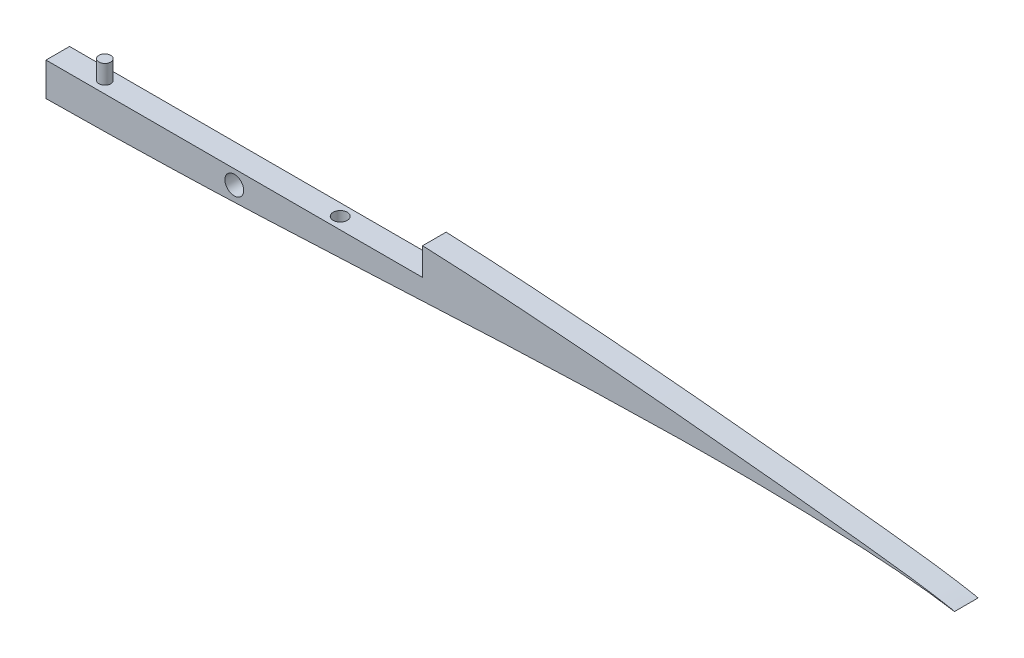
ISO-10303-21;
HEADER;
FILE_DESCRIPTION(('STEP AP214'),'2;1');
FILE_NAME('part.step','',(''),(''),'','','');
FILE_SCHEMA(('AUTOMOTIVE_DESIGN { 1 0 10303 214 1 1 1 1 }'));
ENDSEC;
DATA;
#1=APPLICATION_CONTEXT('core data for automotive mechanical design processes');
#2=APPLICATION_PROTOCOL_DEFINITION('international standard','automotive_design',2000,#1);
#3=PRODUCT_CONTEXT('',#1,'mechanical');
#4=PRODUCT('Part','Part','',(#3));
#5=PRODUCT_RELATED_PRODUCT_CATEGORY('part','',(#4));
#6=PRODUCT_DEFINITION_FORMATION('','',#4);
#7=PRODUCT_DEFINITION_CONTEXT('part definition',#1,'design');
#8=PRODUCT_DEFINITION('design','',#6,#7);
#9=PRODUCT_DEFINITION_SHAPE('','',#8);
#10=(LENGTH_UNIT() NAMED_UNIT(*) SI_UNIT(.MILLI.,.METRE.));
#11=(NAMED_UNIT(*) PLANE_ANGLE_UNIT() SI_UNIT($,.RADIAN.));
#12=(NAMED_UNIT(*) SI_UNIT($,.STERADIAN.) SOLID_ANGLE_UNIT());
#13=UNCERTAINTY_MEASURE_WITH_UNIT(LENGTH_MEASURE(1.E-05),#10,'distance_accuracy_value','');
#14=(GEOMETRIC_REPRESENTATION_CONTEXT(3) GLOBAL_UNCERTAINTY_ASSIGNED_CONTEXT((#13)) GLOBAL_UNIT_ASSIGNED_CONTEXT((#10,
#11,#12)) REPRESENTATION_CONTEXT('',''));
#15=CARTESIAN_POINT('',(0.,0.,0.));
#16=DIRECTION('',(0.,0.,1.));
#17=DIRECTION('',(1.,0.,0.));
#18=AXIS2_PLACEMENT_3D('',#15,#16,#17);
#19=CARTESIAN_POINT('',(161.29,15.1503407577075,-8.9));
#20=DIRECTION('',(1.,0.,0.));
#21=DIRECTION('',(0.,0.,-1.));
#22=AXIS2_PLACEMENT_3D('',#19,#20,#21);
#23=PLANE('',#22);
#24=DIRECTION('',(0.,0.,1.));
#25=VECTOR('',#24,1.);
#26=CARTESIAN_POINT('',(161.29,15.1503407577075,-8.9));
#27=LINE('',#26,#25);
#28=CARTESIAN_POINT('',(161.29,15.1503407577075,-6.35));
#29=VERTEX_POINT('',#28);
#30=CARTESIAN_POINT('',(161.29,15.1503407577075,0.));
#31=VERTEX_POINT('',#30);
#32=EDGE_CURVE('E62',#29,#31,#27,.T.);
#33=ORIENTED_EDGE('',*,*,#32,.T.);
#34=DIRECTION('',(0.,1.,0.));
#35=VECTOR('',#34,1.);
#36=CARTESIAN_POINT('',(161.29,8.84070521921784,0.));
#37=LINE('',#36,#35);
#38=CARTESIAN_POINT('',(161.28999998063,22.5713507156174,0.));
#39=VERTEX_POINT('',#38);
#40=EDGE_CURVE('E139',#31,#39,#37,.T.);
#41=ORIENTED_EDGE('',*,*,#40,.T.);
#42=DIRECTION('',(0.,0.,1.));
#43=VECTOR('',#42,1.);
#44=CARTESIAN_POINT('',(161.290000000003,22.5713507147177,-6.35));
#45=LINE('',#44,#43);
#46=CARTESIAN_POINT('',(161.289999982265,22.5713507155415,-6.35));
#47=VERTEX_POINT('',#46);
#48=EDGE_CURVE('E69',#39,#47,#45,.F.);
#49=ORIENTED_EDGE('',*,*,#48,.T.);
#50=DIRECTION('',(0.,1.,0.));
#51=VECTOR('',#50,1.);
#52=CARTESIAN_POINT('',(161.29,8.84070521921784,-6.35));
#53=LINE('',#52,#51);
#54=EDGE_CURVE('E114',#29,#47,#53,.T.);
#55=ORIENTED_EDGE('',*,*,#54,.F.);
#56=EDGE_LOOP('',(#33,#41,#49,#55));
#57=FACE_BOUND('',#56,.T.);
#58=ADVANCED_FACE('F53',(#57),#23,.F.);
#59=CARTESIAN_POINT('',(59.69,15.1503407577075,-8.9));
#60=DIRECTION('',(0.,-1.,0.));
#61=DIRECTION('',(0.,0.,-1.));
#62=AXIS2_PLACEMENT_3D('',#59,#60,#61);
#63=PLANE('',#62);
#64=CARTESIAN_POINT('',(135.89,15.1503407577075,-3.17500000000001));
#65=DIRECTION('',(0.,1.,0.));
#66=DIRECTION('',(0.,0.,1.));
#67=AXIS2_PLACEMENT_3D('',#64,#65,#66);
#68=CIRCLE('',#67,1.90499999999999);
#69=CARTESIAN_POINT('',(135.89,15.1503407577075,-1.27000000000002));
#70=VERTEX_POINT('',#69);
#71=EDGE_CURVE('E170',#70,#70,#68,.T.);
#72=ORIENTED_EDGE('',*,*,#71,.F.);
#73=EDGE_LOOP('',(#72));
#74=FACE_BOUND('',#73,.T.);
#75=CARTESIAN_POINT('',(72.39,15.1503407577075,-3.175));
#76=DIRECTION('',(0.,-1.,0.));
#77=DIRECTION('',(0.,0.,-1.));
#78=AXIS2_PLACEMENT_3D('',#75,#76,#77);
#79=CIRCLE('',#78,1.5875);
#80=CARTESIAN_POINT('',(72.39,15.1503407577075,-4.7625));
#81=VERTEX_POINT('',#80);
#82=EDGE_CURVE('E12',#81,#81,#79,.F.);
#83=ORIENTED_EDGE('',*,*,#82,.F.);
#84=EDGE_LOOP('',(#83));
#85=FACE_BOUND('',#84,.T.);
#86=DIRECTION('',(0.,0.,1.));
#87=VECTOR('',#86,1.);
#88=CARTESIAN_POINT('',(59.69,15.1503407577075,-8.9));
#89=LINE('',#88,#87);
#90=CARTESIAN_POINT('',(59.69,15.1503407577075,-6.35));
#91=VERTEX_POINT('',#90);
#92=CARTESIAN_POINT('',(59.69,15.1503407577075,0.));
#93=VERTEX_POINT('',#92);
#94=EDGE_CURVE('E102',#91,#93,#89,.T.);
#95=ORIENTED_EDGE('',*,*,#94,.T.);
#96=DIRECTION('',(1.,0.,0.));
#97=VECTOR('',#96,1.);
#98=CARTESIAN_POINT('',(0.,15.1503407577075,0.));
#99=LINE('',#98,#97);
#100=EDGE_CURVE('E175',#93,#31,#99,.T.);
#101=ORIENTED_EDGE('',*,*,#100,.T.);
#102=ORIENTED_EDGE('',*,*,#32,.F.);
#103=DIRECTION('',(1.,0.,0.));
#104=VECTOR('',#103,1.);
#105=CARTESIAN_POINT('',(0.,15.1503407577075,-6.35));
#106=LINE('',#105,#104);
#107=EDGE_CURVE('E107',#91,#29,#106,.T.);
#108=ORIENTED_EDGE('',*,*,#107,.F.);
#109=EDGE_LOOP('',(#95,#101,#102,#108));
#110=FACE_BOUND('',#109,.T.);
#111=ADVANCED_FACE('F158',(#74,#85,#110),#63,.F.);
#112=CARTESIAN_POINT('',(59.69,6.13469849844112,-8.9));
#113=DIRECTION('',(1.,0.,0.));
#114=DIRECTION('',(0.,1.,0.));
#115=AXIS2_PLACEMENT_3D('',#112,#113,#114);
#116=PLANE('',#115);
#117=DIRECTION('',(0.,0.,1.));
#118=VECTOR('',#117,1.);
#119=CARTESIAN_POINT('',(59.69,6.13469849844112,-6.35));
#120=LINE('',#119,#118);
#121=CARTESIAN_POINT('',(59.6900000194774,6.13469849862517,-6.35));
#122=VERTEX_POINT('',#121);
#123=CARTESIAN_POINT('',(59.6900000078065,6.13469849851489,0.));
#124=VERTEX_POINT('',#123);
#125=EDGE_CURVE('E100',#122,#124,#120,.T.);
#126=ORIENTED_EDGE('',*,*,#125,.T.);
#127=DIRECTION('',(0.,1.,0.));
#128=VECTOR('',#127,1.);
#129=CARTESIAN_POINT('',(59.69,8.84070521921812,0.));
#130=LINE('',#129,#128);
#131=EDGE_CURVE('E77',#124,#93,#130,.T.);
#132=ORIENTED_EDGE('',*,*,#131,.T.);
#133=ORIENTED_EDGE('',*,*,#94,.F.);
#134=DIRECTION('',(0.,1.,0.));
#135=VECTOR('',#134,1.);
#136=CARTESIAN_POINT('',(59.69,8.84070521921812,-6.35));
#137=LINE('',#136,#135);
#138=EDGE_CURVE('E98',#122,#91,#137,.T.);
#139=ORIENTED_EDGE('',*,*,#138,.F.);
#140=EDGE_LOOP('',(#126,#132,#133,#139));
#141=FACE_BOUND('',#140,.T.);
#142=ADVANCED_FACE('F55',(#141),#116,.F.);
#143=CARTESIAN_POINT('',(304.799999999981,8.84070521921933,-6.35));
#144=CARTESIAN_POINT('',(304.82012511006,8.84631285964664,-6.35));
#145=CARTESIAN_POINT('',(304.136800474963,9.03902480051447,-6.35));
#146=CARTESIAN_POINT('',(303.375322867857,9.15622667599064,-6.35));
#147=CARTESIAN_POINT('',(301.636958583189,9.50750977522462,-6.35));
#148=CARTESIAN_POINT('',(299.426767542794,9.86946342232527,-6.35));
#149=CARTESIAN_POINT('',(296.518953252407,10.3280137970568,-6.35));
#150=CARTESIAN_POINT('',(293.018467792338,10.8248006115008,-6.35));
#151=CARTESIAN_POINT('',(288.900536794578,11.3604446078168,-6.35));
#152=CARTESIAN_POINT('',(284.20488543612,11.9350149043221,-6.35));
#153=CARTESIAN_POINT('',(278.940836996143,12.5424058482791,-6.35));
#154=CARTESIAN_POINT('',(273.143680748259,13.1966681821014,-6.35));
#155=CARTESIAN_POINT('',(266.817821912119,13.8725849504242,-6.35));
#156=CARTESIAN_POINT('',(260.019791181675,14.6075350842126,-6.35));
#157=CARTESIAN_POINT('',(252.741163128342,15.3430480029051,-6.35));
#158=CARTESIAN_POINT('',(245.055559940884,16.1316410738847,-6.35));
#159=CARTESIAN_POINT('',(236.946583275121,16.9004918519383,-6.35));
#160=CARTESIAN_POINT('',(228.50806834568,17.7310713087232,-6.35));
#161=CARTESIAN_POINT('',(219.707729735365,18.5083518913135,-6.35));
#162=CARTESIAN_POINT('',(210.662190304429,19.3412075828542,-6.35));
#163=CARTESIAN_POINT('',(201.320827802424,20.0634796030617,-6.35));
#164=CARTESIAN_POINT('',(191.81436274904,20.8225568753487,-6.35));
#165=CARTESIAN_POINT('',(182.095576055478,21.4369535138529,-6.35));
#166=CARTESIAN_POINT('',(172.287559076656,22.0672690152254,-6.35));
#167=CARTESIAN_POINT('',(162.356893374379,22.518814519303,-6.35));
#168=CARTESIAN_POINT('',(152.417144653895,22.9887641852325,-6.35));
#169=CARTESIAN_POINT('',(142.44998973437,23.2631888682384,-6.35));
#170=CARTESIAN_POINT('',(132.545731827396,23.5587248765443,-6.35));
#171=CARTESIAN_POINT('',(122.711151747147,23.6306797752969,-6.35));
#172=CARTESIAN_POINT('',(113.011215012495,23.7435191260893,-6.35));
#173=CARTESIAN_POINT('',(103.482364760243,23.6197363639542,-6.35));
#174=CARTESIAN_POINT('',(94.1488885556725,23.5468423795136,-6.35));
#175=CARTESIAN_POINT('',(85.0905583388243,23.210955777479,-6.35));
#176=CARTESIAN_POINT('',(76.2768863370618,22.9416863066447,-6.35));
#177=CARTESIAN_POINT('',(67.8519762746337,22.39335883634,-6.35));
#178=CARTESIAN_POINT('',(59.7069752921567,21.94928194029,-6.35));
#179=CARTESIAN_POINT('',(52.0619893188443,21.2297342150995,-6.35));
#180=CARTESIAN_POINT('',(44.7167570215174,20.6372821517927,-6.35));
#181=CARTESIAN_POINT('',(37.9876033572043,19.7668625247563,-6.35));
#182=CARTESIAN_POINT('',(31.5607732931736,19.0486900589922,-6.35));
#183=CARTESIAN_POINT('',(25.8754576009877,18.0589252374282,-6.35));
#184=CARTESIAN_POINT('',(20.4601924749335,17.2533276483172,-6.35));
#185=CARTESIAN_POINT('',(15.909712958431,16.1912407780387,-6.35));
#186=CARTESIAN_POINT('',(11.7163514600433,15.2935302964436,-6.35));
#187=CARTESIAN_POINT('',(8.10119886749456,14.3664770407369,-6.35));
#188=CARTESIAN_POINT('',(5.23539854810055,13.3140242079338,-6.35));
#189=CARTESIAN_POINT('',(2.829740512964,12.2266690037572,-6.35));
#190=CARTESIAN_POINT('',(1.32933654825175,11.0569945812739,-6.35));
#191=CARTESIAN_POINT('',(0.30893287897361,9.96202306394524,-6.35));
#192=CARTESIAN_POINT('',(-0.327964979036775,9.08514150658472,-6.35));
#193=CARTESIAN_POINT('',(0.386118085619972,8.46863099498004,-6.35));
#194=CARTESIAN_POINT('',(1.48628448770953,8.09706488826065,-6.35));
#195=CARTESIAN_POINT('',(2.91553478278213,7.53360793392789,-6.35));
#196=CARTESIAN_POINT('',(5.42599691726199,7.31234324596362,-6.35));
#197=CARTESIAN_POINT('',(8.21752623726995,6.88917090941392,-6.35));
#198=CARTESIAN_POINT('',(11.8176125283229,6.78962282805451,-6.35));
#199=CARTESIAN_POINT('',(15.8861038773983,6.48630873361207,-6.35));
#200=CARTESIAN_POINT('',(20.6137138087003,6.43225221234843,-6.35));
#201=CARTESIAN_POINT('',(25.8553271607826,6.21288829812365,-6.35));
#202=CARTESIAN_POINT('',(31.6684761822158,6.20211037559508,-6.35));
#203=CARTESIAN_POINT('',(37.9798321369844,6.05679272016892,-6.35));
#204=CARTESIAN_POINT('',(44.7918582149559,6.09900778163849,-6.35));
#205=CARTESIAN_POINT('',(52.0608929040826,6.03561890061155,-6.35));
#206=CARTESIAN_POINT('',(59.7564196110845,6.14957068083345,-6.35));
#207=CARTESIAN_POINT('',(67.8558049315251,6.18195746075115,-6.35));
#208=CARTESIAN_POINT('',(76.3079562173627,6.37315809616739,-6.35));
#209=CARTESIAN_POINT('',(85.0990793898782,6.50944224275813,-6.35));
#210=CARTESIAN_POINT('',(94.1629433787314,6.79146182038362,-6.35));
#211=CARTESIAN_POINT('',(103.491777789475,7.04316865662328,-6.35));
#212=CARTESIAN_POINT('',(113.013413144931,7.42201917573048,-6.35));
#213=CARTESIAN_POINT('',(122.717663003627,7.79686999507074,-6.35));
#214=CARTESIAN_POINT('',(132.538395015459,8.24919641541521,-6.35));
#215=CARTESIAN_POINT('',(142.452771401736,8.70791868634346,-6.35));
#216=CARTESIAN_POINT('',(152.399232196453,9.21715400388623,-6.35));
#217=CARTESIAN_POINT('',(162.35109841657,9.71352509584465,-6.35));
#218=CARTESIAN_POINT('',(172.257801894288,10.2036948771646,-6.35));
#219=CARTESIAN_POINT('',(182.087133464018,10.6374973333016,-6.35));
#220=CARTESIAN_POINT('',(191.780226110981,11.0623133842515,-6.35));
#221=CARTESIAN_POINT('',(201.314005615636,11.3985886892134,-6.35));
#222=CARTESIAN_POINT('',(210.630363501542,11.7121928803827,-6.35));
#223=CARTESIAN_POINT('',(219.704890932239,11.9286624067955,-6.35));
#224=CARTESIAN_POINT('',(228.487751662369,12.1054744270705,-6.35));
#225=CARTESIAN_POINT('',(236.947100218697,12.1954386311323,-6.35));
#226=CARTESIAN_POINT('',(245.043170333018,12.2291586570555,-6.35));
#227=CARTESIAN_POINT('',(252.74280625349,12.1819462408189,-6.35));
#228=CARTESIAN_POINT('',(260.013825454217,12.0647701516025,-6.35));
#229=CARTESIAN_POINT('',(266.823542699866,11.8789776538503,-6.35));
#230=CARTESIAN_POINT('',(273.143443180097,11.6442035769191,-6.35));
#231=CARTESIAN_POINT('',(278.944519004025,11.36127309492,-6.35));
#232=CARTESIAN_POINT('',(284.206358459494,11.0500384731332,-6.35));
#233=CARTESIAN_POINT('',(288.903664518862,10.7123435043259,-6.35));
#234=CARTESIAN_POINT('',(293.017371724129,10.3531800278744,-6.35));
#235=CARTESIAN_POINT('',(296.521945453167,9.99731317256952,-6.35));
#236=CARTESIAN_POINT('',(299.426457428338,9.6371895248963,-6.35));
#237=CARTESIAN_POINT('',(301.630485971763,9.33803631339126,-6.35));
#238=CARTESIAN_POINT('',(303.370853203754,9.06465102074614,-6.35));
#239=CARTESIAN_POINT('',(304.1195160819,8.95189903083136,-6.35));
#240=CARTESIAN_POINT('',(304.78294649836,8.83595344868314,-6.35));
#241=CARTESIAN_POINT('',(304.799999999981,8.84070521921933,-6.35));
#242=B_SPLINE_CURVE_WITH_KNOTS('',3,(#143,#144,#145,#146,#147,#148,#149,#150,#151,#152,#153,
#154,#155,#156,#157,#158,#159,#160,#161,#162,#163,#164,#165,#166,#167,#168,#169,#170,#171,#172,
#173,#174,#175,#176,#177,#178,#179,#180,#181,#182,#183,#184,#185,#186,#187,#188,#189,#190,#191,
#192,#193,#194,#195,#196,#197,#198,#199,#200,#201,#202,#203,#204,#205,#206,#207,#208,#209,#210,
#211,#212,#213,#214,#215,#216,#217,#218,#219,#220,#221,#222,#223,#224,#225,#226,#227,#228,#229,
#230,#231,#232,#233,#234,#235,#236,#237,#238,#239,#240,#241),.UNSPECIFIED.,.T.,.F.,(4,1,1,1,1,1,
1,1,1,1,1,1,1,1,1,1,1,1,1,1,1,1,1,1,1,1,1,1,1,1,1,1,1,1,1,1,1,1,1,1,1,1,1,1,1,1,1,1,1,1,1,1,1,1,
1,1,1,1,1,1,1,1,1,1,1,1,1,1,1,1,1,1,1,1,1,1,1,1,1,1,1,1,1,1,1,1,1,1,1,1,1,1,1,1,1,1,4),(0.,
0.000652375800474001,0.00240344824305293,0.00525656825777616,0.00916576414525399,
0.0140967507887129,0.0200220121070894,0.0268963436763612,0.0347063828713069,0.0434144575923079,
0.0529900197240517,0.0633968094728075,0.0746012542197577,0.0865310302989372,0.099154299734113,
0.112392946202992,0.126224491561968,0.140544888717164,0.155318673337255,0.170431652347923,
0.185859272314617,0.201486855100767,0.21729337680491,0.233167489320596,0.249086100090761,
0.264958726174628,0.280747986632832,0.296380919150158,0.311801213814499,0.326956198280747,
0.34178274714053,0.356247564285208,0.370274835051458,0.383861908178782,0.396887692238994,
0.409401211668324,0.421252505987224,0.432540778472774,0.44306525269204,0.452987148289923,
0.462044499089512,0.470525623352609,0.478015713742355,0.484719935647003,0.490901449374763,
0.496493482376747,0.501934630302492,0.506331603851298,0.510717666514293,0.511954044649899,
0.514195842006017,0.517506907461632,0.521314719070869,0.526107089755545,0.531740962786565,
0.538337761174815,0.545822104103918,0.554208083816506,0.563431264261174,0.573484426850772,
0.584310043394845,0.595866543172384,0.608108296907278,0.620979221659939,0.634441733895477,
0.648424207084819,0.662880137047378,0.677739163464503,0.692957281121996,0.708452452705004,
0.724176515371476,0.740041983978664,0.755990469053507,0.771938352799948,0.787811293886201,
0.803535896442132,0.819040498411977,0.834255057735326,0.849121194519524,0.863570137224621,
0.877552378440428,0.891006015922545,0.903874254768139,0.916114355519662,0.927680383940068,
0.938530909249465,0.948621564264013,0.957908586509766,0.96636362872513,0.97395265018994,
0.980639894713798,0.986402982837544,0.991206560358905,0.995011197109476,0.997773025834374,
0.999447193494769,1.),.UNSPECIFIED.);
#243=DIRECTION('',(0.,0.,1.));
#244=VECTOR('',#243,1.);
#245=SURFACE_OF_LINEAR_EXTRUSION('',#242,#244);
#246=ORIENTED_EDGE('',*,*,#125,.F.);
#247=CARTESIAN_POINT('',(304.799999999981,8.84070521921933,-6.35));
#248=CARTESIAN_POINT('',(304.82012511006,8.84631285964664,-6.35));
#249=CARTESIAN_POINT('',(304.136800474963,9.03902480051447,-6.35));
#250=CARTESIAN_POINT('',(303.375322867857,9.15622667599064,-6.35));
#251=CARTESIAN_POINT('',(301.636958583189,9.50750977522462,-6.35));
#252=CARTESIAN_POINT('',(299.426767542794,9.86946342232527,-6.35));
#253=CARTESIAN_POINT('',(296.518953252407,10.3280137970568,-6.35));
#254=CARTESIAN_POINT('',(293.018467792338,10.8248006115008,-6.35));
#255=CARTESIAN_POINT('',(288.900536794578,11.3604446078168,-6.35));
#256=CARTESIAN_POINT('',(284.20488543612,11.9350149043221,-6.35));
#257=CARTESIAN_POINT('',(278.940836996143,12.5424058482791,-6.35));
#258=CARTESIAN_POINT('',(273.143680748259,13.1966681821014,-6.35));
#259=CARTESIAN_POINT('',(266.817821912119,13.8725849504242,-6.35));
#260=CARTESIAN_POINT('',(260.019791181675,14.6075350842126,-6.35));
#261=CARTESIAN_POINT('',(252.741163128342,15.3430480029051,-6.35));
#262=CARTESIAN_POINT('',(245.055559940884,16.1316410738847,-6.35));
#263=CARTESIAN_POINT('',(236.946583275121,16.9004918519383,-6.35));
#264=CARTESIAN_POINT('',(228.50806834568,17.7310713087232,-6.35));
#265=CARTESIAN_POINT('',(219.707729735365,18.5083518913135,-6.35));
#266=CARTESIAN_POINT('',(210.662190304429,19.3412075828542,-6.35));
#267=CARTESIAN_POINT('',(201.320827802424,20.0634796030617,-6.35));
#268=CARTESIAN_POINT('',(191.81436274904,20.8225568753487,-6.35));
#269=CARTESIAN_POINT('',(182.095576055478,21.4369535138529,-6.35));
#270=CARTESIAN_POINT('',(172.287559076656,22.0672690152254,-6.35));
#271=CARTESIAN_POINT('',(162.356893374379,22.518814519303,-6.35));
#272=CARTESIAN_POINT('',(152.417144653895,22.9887641852325,-6.35));
#273=CARTESIAN_POINT('',(142.44998973437,23.2631888682384,-6.35));
#274=CARTESIAN_POINT('',(132.545731827396,23.5587248765443,-6.35));
#275=CARTESIAN_POINT('',(122.711151747147,23.6306797752969,-6.35));
#276=CARTESIAN_POINT('',(113.011215012495,23.7435191260893,-6.35));
#277=CARTESIAN_POINT('',(103.482364760243,23.6197363639542,-6.35));
#278=CARTESIAN_POINT('',(94.1488885556725,23.5468423795136,-6.35));
#279=CARTESIAN_POINT('',(85.0905583388243,23.210955777479,-6.35));
#280=CARTESIAN_POINT('',(76.2768863370618,22.9416863066447,-6.35));
#281=CARTESIAN_POINT('',(67.8519762746337,22.39335883634,-6.35));
#282=CARTESIAN_POINT('',(59.7069752921567,21.94928194029,-6.35));
#283=CARTESIAN_POINT('',(52.0619893188443,21.2297342150995,-6.35));
#284=CARTESIAN_POINT('',(44.7167570215174,20.6372821517927,-6.35));
#285=CARTESIAN_POINT('',(37.9876033572043,19.7668625247563,-6.35));
#286=CARTESIAN_POINT('',(31.5607732931736,19.0486900589922,-6.35));
#287=CARTESIAN_POINT('',(25.8754576009877,18.0589252374282,-6.35));
#288=CARTESIAN_POINT('',(20.4601924749335,17.2533276483172,-6.35));
#289=CARTESIAN_POINT('',(15.909712958431,16.1912407780387,-6.35));
#290=CARTESIAN_POINT('',(11.7163514600433,15.2935302964436,-6.35));
#291=CARTESIAN_POINT('',(8.10119886749456,14.3664770407369,-6.35));
#292=CARTESIAN_POINT('',(5.23539854810055,13.3140242079338,-6.35));
#293=CARTESIAN_POINT('',(2.829740512964,12.2266690037572,-6.35));
#294=CARTESIAN_POINT('',(1.32933654825175,11.0569945812739,-6.35));
#295=CARTESIAN_POINT('',(0.30893287897361,9.96202306394524,-6.35));
#296=CARTESIAN_POINT('',(-0.327964979036775,9.08514150658472,-6.35));
#297=CARTESIAN_POINT('',(0.386118085619972,8.46863099498004,-6.35));
#298=CARTESIAN_POINT('',(1.48628448770953,8.09706488826065,-6.35));
#299=CARTESIAN_POINT('',(2.91553478278213,7.53360793392789,-6.35));
#300=CARTESIAN_POINT('',(5.42599691726199,7.31234324596362,-6.35));
#301=CARTESIAN_POINT('',(8.21752623726995,6.88917090941392,-6.35));
#302=CARTESIAN_POINT('',(11.8176125283229,6.78962282805451,-6.35));
#303=CARTESIAN_POINT('',(15.8861038773983,6.48630873361207,-6.35));
#304=CARTESIAN_POINT('',(20.6137138087003,6.43225221234843,-6.35));
#305=CARTESIAN_POINT('',(25.8553271607826,6.21288829812365,-6.35));
#306=CARTESIAN_POINT('',(31.6684761822158,6.20211037559508,-6.35));
#307=CARTESIAN_POINT('',(37.9798321369844,6.05679272016892,-6.35));
#308=CARTESIAN_POINT('',(44.7918582149559,6.09900778163849,-6.35));
#309=CARTESIAN_POINT('',(52.0608929040826,6.03561890061155,-6.35));
#310=CARTESIAN_POINT('',(59.7564196110845,6.14957068083345,-6.35));
#311=CARTESIAN_POINT('',(67.8558049315251,6.18195746075115,-6.35));
#312=CARTESIAN_POINT('',(76.3079562173627,6.37315809616739,-6.35));
#313=CARTESIAN_POINT('',(85.0990793898782,6.50944224275813,-6.35));
#314=CARTESIAN_POINT('',(94.1629433787314,6.79146182038362,-6.35));
#315=CARTESIAN_POINT('',(103.491777789475,7.04316865662328,-6.35));
#316=CARTESIAN_POINT('',(113.013413144931,7.42201917573048,-6.35));
#317=CARTESIAN_POINT('',(122.717663003627,7.79686999507074,-6.35));
#318=CARTESIAN_POINT('',(132.538395015459,8.24919641541521,-6.35));
#319=CARTESIAN_POINT('',(142.452771401736,8.70791868634346,-6.35));
#320=CARTESIAN_POINT('',(152.399232196453,9.21715400388623,-6.35));
#321=CARTESIAN_POINT('',(162.35109841657,9.71352509584465,-6.35));
#322=CARTESIAN_POINT('',(172.257801894288,10.2036948771646,-6.35));
#323=CARTESIAN_POINT('',(182.087133464018,10.6374973333016,-6.35));
#324=CARTESIAN_POINT('',(191.780226110981,11.0623133842515,-6.35));
#325=CARTESIAN_POINT('',(201.314005615636,11.3985886892134,-6.35));
#326=CARTESIAN_POINT('',(210.630363501542,11.7121928803827,-6.35));
#327=CARTESIAN_POINT('',(219.704890932239,11.9286624067955,-6.35));
#328=CARTESIAN_POINT('',(228.487751662369,12.1054744270705,-6.35));
#329=CARTESIAN_POINT('',(236.947100218697,12.1954386311323,-6.35));
#330=CARTESIAN_POINT('',(245.043170333018,12.2291586570555,-6.35));
#331=CARTESIAN_POINT('',(252.74280625349,12.1819462408189,-6.35));
#332=CARTESIAN_POINT('',(260.013825454217,12.0647701516025,-6.35));
#333=CARTESIAN_POINT('',(266.823542699866,11.8789776538503,-6.35));
#334=CARTESIAN_POINT('',(273.143443180097,11.6442035769191,-6.35));
#335=CARTESIAN_POINT('',(278.944519004025,11.36127309492,-6.35));
#336=CARTESIAN_POINT('',(284.206358459494,11.0500384731332,-6.35));
#337=CARTESIAN_POINT('',(288.903664518862,10.7123435043259,-6.35));
#338=CARTESIAN_POINT('',(293.017371724129,10.3531800278744,-6.35));
#339=CARTESIAN_POINT('',(296.521945453167,9.99731317256952,-6.35));
#340=CARTESIAN_POINT('',(299.426457428338,9.6371895248963,-6.35));
#341=CARTESIAN_POINT('',(301.630485971763,9.33803631339126,-6.35));
#342=CARTESIAN_POINT('',(303.370853203754,9.06465102074614,-6.35));
#343=CARTESIAN_POINT('',(304.1195160819,8.95189903083136,-6.35));
#344=CARTESIAN_POINT('',(304.78294649836,8.83595344868314,-6.35));
#345=CARTESIAN_POINT('',(304.799999999981,8.84070521921933,-6.35));
#346=B_SPLINE_CURVE_WITH_KNOTS('',3,(#247,#248,#249,#250,#251,#252,#253,#254,#255,#256,#257,
#258,#259,#260,#261,#262,#263,#264,#265,#266,#267,#268,#269,#270,#271,#272,#273,#274,#275,#276,
#277,#278,#279,#280,#281,#282,#283,#284,#285,#286,#287,#288,#289,#290,#291,#292,#293,#294,#295,
#296,#297,#298,#299,#300,#301,#302,#303,#304,#305,#306,#307,#308,#309,#310,#311,#312,#313,#314,
#315,#316,#317,#318,#319,#320,#321,#322,#323,#324,#325,#326,#327,#328,#329,#330,#331,#332,#333,
#334,#335,#336,#337,#338,#339,#340,#341,#342,#343,#344,#345),.UNSPECIFIED.,.T.,.F.,(4,1,1,1,1,1,
1,1,1,1,1,1,1,1,1,1,1,1,1,1,1,1,1,1,1,1,1,1,1,1,1,1,1,1,1,1,1,1,1,1,1,1,1,1,1,1,1,1,1,1,1,1,1,1,
1,1,1,1,1,1,1,1,1,1,1,1,1,1,1,1,1,1,1,1,1,1,1,1,1,1,1,1,1,1,1,1,1,1,1,1,1,1,1,1,1,1,4),(0.,
0.000652375800474001,0.00240344824305293,0.00525656825777616,0.00916576414525399,
0.0140967507887129,0.0200220121070894,0.0268963436763612,0.0347063828713069,0.0434144575923079,
0.0529900197240517,0.0633968094728075,0.0746012542197577,0.0865310302989372,0.099154299734113,
0.112392946202992,0.126224491561968,0.140544888717164,0.155318673337255,0.170431652347923,
0.185859272314617,0.201486855100767,0.21729337680491,0.233167489320596,0.249086100090761,
0.264958726174628,0.280747986632832,0.296380919150158,0.311801213814499,0.326956198280747,
0.34178274714053,0.356247564285208,0.370274835051458,0.383861908178782,0.396887692238994,
0.409401211668324,0.421252505987224,0.432540778472774,0.44306525269204,0.452987148289923,
0.462044499089512,0.470525623352609,0.478015713742355,0.484719935647003,0.490901449374763,
0.496493482376747,0.501934630302492,0.506331603851298,0.510717666514293,0.511954044649899,
0.514195842006017,0.517506907461632,0.521314719070869,0.526107089755545,0.531740962786565,
0.538337761174815,0.545822104103918,0.554208083816506,0.563431264261174,0.573484426850772,
0.584310043394845,0.595866543172384,0.608108296907278,0.620979221659939,0.634441733895477,
0.648424207084819,0.662880137047378,0.677739163464503,0.692957281121996,0.708452452705004,
0.724176515371476,0.740041983978664,0.755990469053507,0.771938352799948,0.787811293886201,
0.803535896442132,0.819040498411977,0.834255057735326,0.849121194519524,0.863570137224621,
0.877552378440428,0.891006015922545,0.903874254768139,0.916114355519662,0.927680383940068,
0.938530909249465,0.948621564264013,0.957908586509766,0.96636362872513,0.97395265018994,
0.980639894713798,0.986402982837544,0.991206560358905,0.995011197109476,0.997773025834374,
0.999447193494769,1.),.UNSPECIFIED.);
#347=EDGE_CURVE('E109',#122,#47,#346,.T.);
#348=ORIENTED_EDGE('',*,*,#347,.T.);
#349=ORIENTED_EDGE('',*,*,#48,.F.);
#350=CARTESIAN_POINT('',(304.799999999981,8.84070521921933,0.));
#351=CARTESIAN_POINT('',(304.82012511006,8.84631285964664,0.));
#352=CARTESIAN_POINT('',(304.136800474963,9.03902480051447,0.));
#353=CARTESIAN_POINT('',(303.375322867857,9.15622667599064,0.));
#354=CARTESIAN_POINT('',(301.636958583189,9.50750977522462,0.));
#355=CARTESIAN_POINT('',(299.426767542794,9.86946342232527,0.));
#356=CARTESIAN_POINT('',(296.518953252407,10.3280137970568,0.));
#357=CARTESIAN_POINT('',(293.018467792338,10.8248006115008,0.));
#358=CARTESIAN_POINT('',(288.900536794578,11.3604446078168,0.));
#359=CARTESIAN_POINT('',(284.20488543612,11.9350149043221,0.));
#360=CARTESIAN_POINT('',(278.940836996143,12.5424058482791,0.));
#361=CARTESIAN_POINT('',(273.143680748259,13.1966681821014,0.));
#362=CARTESIAN_POINT('',(266.817821912119,13.8725849504242,0.));
#363=CARTESIAN_POINT('',(260.019791181675,14.6075350842126,0.));
#364=CARTESIAN_POINT('',(252.741163128342,15.3430480029051,0.));
#365=CARTESIAN_POINT('',(245.055559940884,16.1316410738847,0.));
#366=CARTESIAN_POINT('',(236.946583275121,16.9004918519383,0.));
#367=CARTESIAN_POINT('',(228.50806834568,17.7310713087232,0.));
#368=CARTESIAN_POINT('',(219.707729735365,18.5083518913135,0.));
#369=CARTESIAN_POINT('',(210.662190304429,19.3412075828542,0.));
#370=CARTESIAN_POINT('',(201.320827802424,20.0634796030617,0.));
#371=CARTESIAN_POINT('',(191.81436274904,20.8225568753487,0.));
#372=CARTESIAN_POINT('',(182.095576055478,21.4369535138529,0.));
#373=CARTESIAN_POINT('',(172.287559076656,22.0672690152254,0.));
#374=CARTESIAN_POINT('',(162.356893374379,22.518814519303,0.));
#375=CARTESIAN_POINT('',(152.417144653895,22.9887641852325,0.));
#376=CARTESIAN_POINT('',(142.44998973437,23.2631888682384,0.));
#377=CARTESIAN_POINT('',(132.545731827396,23.5587248765443,0.));
#378=CARTESIAN_POINT('',(122.711151747147,23.6306797752969,0.));
#379=CARTESIAN_POINT('',(113.011215012495,23.7435191260893,0.));
#380=CARTESIAN_POINT('',(103.482364760243,23.6197363639542,0.));
#381=CARTESIAN_POINT('',(94.1488885556725,23.5468423795136,0.));
#382=CARTESIAN_POINT('',(85.0905583388243,23.210955777479,0.));
#383=CARTESIAN_POINT('',(76.2768863370618,22.9416863066447,0.));
#384=CARTESIAN_POINT('',(67.8519762746337,22.39335883634,0.));
#385=CARTESIAN_POINT('',(59.7069752921567,21.94928194029,0.));
#386=CARTESIAN_POINT('',(52.0619893188443,21.2297342150995,0.));
#387=CARTESIAN_POINT('',(44.7167570215174,20.6372821517927,0.));
#388=CARTESIAN_POINT('',(37.9876033572043,19.7668625247563,0.));
#389=CARTESIAN_POINT('',(31.5607732931736,19.0486900589922,0.));
#390=CARTESIAN_POINT('',(25.8754576009877,18.0589252374282,0.));
#391=CARTESIAN_POINT('',(20.4601924749335,17.2533276483172,0.));
#392=CARTESIAN_POINT('',(15.909712958431,16.1912407780387,0.));
#393=CARTESIAN_POINT('',(11.7163514600433,15.2935302964436,0.));
#394=CARTESIAN_POINT('',(8.10119886749456,14.3664770407369,0.));
#395=CARTESIAN_POINT('',(5.23539854810055,13.3140242079338,0.));
#396=CARTESIAN_POINT('',(2.829740512964,12.2266690037572,0.));
#397=CARTESIAN_POINT('',(1.32933654825175,11.0569945812739,0.));
#398=CARTESIAN_POINT('',(0.30893287897361,9.96202306394524,0.));
#399=CARTESIAN_POINT('',(-0.327964979036775,9.08514150658472,0.));
#400=CARTESIAN_POINT('',(0.386118085619972,8.46863099498004,0.));
#401=CARTESIAN_POINT('',(1.48628448770953,8.09706488826065,0.));
#402=CARTESIAN_POINT('',(2.91553478278213,7.53360793392789,0.));
#403=CARTESIAN_POINT('',(5.42599691726199,7.31234324596362,0.));
#404=CARTESIAN_POINT('',(8.21752623726995,6.88917090941392,0.));
#405=CARTESIAN_POINT('',(11.8176125283229,6.78962282805451,0.));
#406=CARTESIAN_POINT('',(15.8861038773983,6.48630873361207,0.));
#407=CARTESIAN_POINT('',(20.6137138087003,6.43225221234843,0.));
#408=CARTESIAN_POINT('',(25.8553271607826,6.21288829812365,0.));
#409=CARTESIAN_POINT('',(31.6684761822158,6.20211037559508,0.));
#410=CARTESIAN_POINT('',(37.9798321369844,6.05679272016892,0.));
#411=CARTESIAN_POINT('',(44.7918582149559,6.09900778163849,0.));
#412=CARTESIAN_POINT('',(52.0608929040826,6.03561890061155,0.));
#413=CARTESIAN_POINT('',(59.7564196110845,6.14957068083345,0.));
#414=CARTESIAN_POINT('',(67.8558049315251,6.18195746075115,0.));
#415=CARTESIAN_POINT('',(76.3079562173627,6.37315809616739,0.));
#416=CARTESIAN_POINT('',(85.0990793898782,6.50944224275813,0.));
#417=CARTESIAN_POINT('',(94.1629433787314,6.79146182038362,0.));
#418=CARTESIAN_POINT('',(103.491777789475,7.04316865662328,0.));
#419=CARTESIAN_POINT('',(113.013413144931,7.42201917573048,0.));
#420=CARTESIAN_POINT('',(122.717663003627,7.79686999507074,0.));
#421=CARTESIAN_POINT('',(132.538395015459,8.24919641541521,0.));
#422=CARTESIAN_POINT('',(142.452771401736,8.70791868634346,0.));
#423=CARTESIAN_POINT('',(152.399232196453,9.21715400388623,0.));
#424=CARTESIAN_POINT('',(162.35109841657,9.71352509584465,0.));
#425=CARTESIAN_POINT('',(172.257801894288,10.2036948771646,0.));
#426=CARTESIAN_POINT('',(182.087133464018,10.6374973333016,0.));
#427=CARTESIAN_POINT('',(191.780226110981,11.0623133842515,0.));
#428=CARTESIAN_POINT('',(201.314005615636,11.3985886892134,0.));
#429=CARTESIAN_POINT('',(210.630363501542,11.7121928803827,0.));
#430=CARTESIAN_POINT('',(219.704890932239,11.9286624067955,0.));
#431=CARTESIAN_POINT('',(228.487751662369,12.1054744270705,0.));
#432=CARTESIAN_POINT('',(236.947100218697,12.1954386311323,0.));
#433=CARTESIAN_POINT('',(245.043170333018,12.2291586570555,0.));
#434=CARTESIAN_POINT('',(252.74280625349,12.1819462408189,0.));
#435=CARTESIAN_POINT('',(260.013825454217,12.0647701516025,0.));
#436=CARTESIAN_POINT('',(266.823542699866,11.8789776538503,0.));
#437=CARTESIAN_POINT('',(273.143443180097,11.6442035769191,0.));
#438=CARTESIAN_POINT('',(278.944519004025,11.36127309492,0.));
#439=CARTESIAN_POINT('',(284.206358459494,11.0500384731332,0.));
#440=CARTESIAN_POINT('',(288.903664518862,10.7123435043259,0.));
#441=CARTESIAN_POINT('',(293.017371724129,10.3531800278744,0.));
#442=CARTESIAN_POINT('',(296.521945453167,9.99731317256952,0.));
#443=CARTESIAN_POINT('',(299.426457428338,9.6371895248963,0.));
#444=CARTESIAN_POINT('',(301.630485971763,9.33803631339126,0.));
#445=CARTESIAN_POINT('',(303.370853203754,9.06465102074614,0.));
#446=CARTESIAN_POINT('',(304.1195160819,8.95189903083136,0.));
#447=CARTESIAN_POINT('',(304.78294649836,8.83595344868314,0.));
#448=CARTESIAN_POINT('',(304.799999999981,8.84070521921933,0.));
#449=B_SPLINE_CURVE_WITH_KNOTS('',3,(#350,#351,#352,#353,#354,#355,#356,#357,#358,#359,#360,
#361,#362,#363,#364,#365,#366,#367,#368,#369,#370,#371,#372,#373,#374,#375,#376,#377,#378,#379,
#380,#381,#382,#383,#384,#385,#386,#387,#388,#389,#390,#391,#392,#393,#394,#395,#396,#397,#398,
#399,#400,#401,#402,#403,#404,#405,#406,#407,#408,#409,#410,#411,#412,#413,#414,#415,#416,#417,
#418,#419,#420,#421,#422,#423,#424,#425,#426,#427,#428,#429,#430,#431,#432,#433,#434,#435,#436,
#437,#438,#439,#440,#441,#442,#443,#444,#445,#446,#447,#448),.UNSPECIFIED.,.T.,.F.,(4,1,1,1,1,1,
1,1,1,1,1,1,1,1,1,1,1,1,1,1,1,1,1,1,1,1,1,1,1,1,1,1,1,1,1,1,1,1,1,1,1,1,1,1,1,1,1,1,1,1,1,1,1,1,
1,1,1,1,1,1,1,1,1,1,1,1,1,1,1,1,1,1,1,1,1,1,1,1,1,1,1,1,1,1,1,1,1,1,1,1,1,1,1,1,1,1,4),(0.,
0.000652375800474001,0.00240344824305293,0.00525656825777616,0.00916576414525399,
0.0140967507887129,0.0200220121070894,0.0268963436763612,0.0347063828713069,0.0434144575923079,
0.0529900197240517,0.0633968094728075,0.0746012542197577,0.0865310302989372,0.099154299734113,
0.112392946202992,0.126224491561968,0.140544888717164,0.155318673337255,0.170431652347923,
0.185859272314617,0.201486855100767,0.21729337680491,0.233167489320596,0.249086100090761,
0.264958726174628,0.280747986632832,0.296380919150158,0.311801213814499,0.326956198280747,
0.34178274714053,0.356247564285208,0.370274835051458,0.383861908178782,0.396887692238994,
0.409401211668324,0.421252505987224,0.432540778472774,0.44306525269204,0.452987148289923,
0.462044499089512,0.470525623352609,0.478015713742355,0.484719935647003,0.490901449374763,
0.496493482376747,0.501934630302492,0.506331603851298,0.510717666514293,0.511954044649899,
0.514195842006017,0.517506907461632,0.521314719070869,0.526107089755545,0.531740962786565,
0.538337761174815,0.545822104103918,0.554208083816506,0.563431264261174,0.573484426850772,
0.584310043394845,0.595866543172384,0.608108296907278,0.620979221659939,0.634441733895477,
0.648424207084819,0.662880137047378,0.677739163464503,0.692957281121996,0.708452452705004,
0.724176515371476,0.740041983978664,0.755990469053507,0.771938352799948,0.787811293886201,
0.803535896442132,0.819040498411977,0.834255057735326,0.849121194519524,0.863570137224621,
0.877552378440428,0.891006015922545,0.903874254768139,0.916114355519662,0.927680383940068,
0.938530909249465,0.948621564264013,0.957908586509766,0.96636362872513,0.97395265018994,
0.980639894713798,0.986402982837544,0.991206560358905,0.995011197109476,0.997773025834374,
0.999447193494769,1.),.UNSPECIFIED.);
#450=EDGE_CURVE('E110',#124,#39,#449,.T.);
#451=ORIENTED_EDGE('',*,*,#450,.F.);
#452=EDGE_LOOP('',(#246,#348,#349,#451));
#453=FACE_BOUND('',#452,.T.);
#454=ADVANCED_FACE('F108',(#453),#245,.T.);
#455=CARTESIAN_POINT('',(0.,8.84070521921784,-6.35));
#456=DIRECTION('',(0.,0.,1.));
#457=DIRECTION('',(1.,0.,0.));
#458=AXIS2_PLACEMENT_3D('',#455,#456,#457);
#459=PLANE('',#458);
#460=CARTESIAN_POINT('',(110.49,11.3403407577075,-6.35));
#461=DIRECTION('',(0.,0.,1.));
#462=DIRECTION('',(1.,0.,0.));
#463=AXIS2_PLACEMENT_3D('',#460,#461,#462);
#464=CIRCLE('',#463,2.54);
#465=CARTESIAN_POINT('',(113.03,11.3403407577075,-6.35));
#466=VERTEX_POINT('',#465);
#467=EDGE_CURVE('E204',#466,#466,#464,.T.);
#468=ORIENTED_EDGE('',*,*,#467,.T.);
#469=EDGE_LOOP('',(#468));
#470=FACE_BOUND('',#469,.T.);
#471=ORIENTED_EDGE('',*,*,#347,.F.);
#472=ORIENTED_EDGE('',*,*,#138,.T.);
#473=ORIENTED_EDGE('',*,*,#107,.T.);
#474=ORIENTED_EDGE('',*,*,#54,.T.);
#475=EDGE_LOOP('',(#471,#472,#473,#474));
#476=FACE_BOUND('',#475,.T.);
#477=ADVANCED_FACE('F113',(#470,#476),#459,.F.);
#478=CARTESIAN_POINT('',(0.,8.84070521921784,0.));
#479=DIRECTION('',(0.,0.,1.));
#480=DIRECTION('',(1.,0.,0.));
#481=AXIS2_PLACEMENT_3D('',#478,#479,#480);
#482=PLANE('',#481);
#483=CARTESIAN_POINT('',(110.49,11.3403407577075,0.));
#484=DIRECTION('',(0.,0.,1.));
#485=DIRECTION('',(1.,0.,0.));
#486=AXIS2_PLACEMENT_3D('',#483,#484,#485);
#487=CIRCLE('',#486,2.54);
#488=CARTESIAN_POINT('',(113.03,11.3403407577075,0.));
#489=VERTEX_POINT('',#488);
#490=EDGE_CURVE('E206',#489,#489,#487,.T.);
#491=ORIENTED_EDGE('',*,*,#490,.F.);
#492=EDGE_LOOP('',(#491));
#493=FACE_BOUND('',#492,.T.);
#494=ORIENTED_EDGE('',*,*,#131,.F.);
#495=ORIENTED_EDGE('',*,*,#450,.T.);
#496=ORIENTED_EDGE('',*,*,#40,.F.);
#497=ORIENTED_EDGE('',*,*,#100,.F.);
#498=EDGE_LOOP('',(#494,#495,#496,#497));
#499=FACE_BOUND('',#498,.T.);
#500=ADVANCED_FACE('F152',(#493,#499),#482,.T.);
#501=CARTESIAN_POINT('',(72.39,20.2303407577075,-3.175));
#502=DIRECTION('',(0.,-1.,0.));
#503=DIRECTION('',(0.,0.,-1.));
#504=AXIS2_PLACEMENT_3D('',#501,#502,#503);
#505=CYLINDRICAL_SURFACE('',#504,1.5875);
#506=ORIENTED_EDGE('',*,*,#82,.T.);
#507=EDGE_LOOP('',(#506));
#508=FACE_BOUND('',#507,.T.);
#509=CARTESIAN_POINT('',(72.39,20.2303407577075,-3.175));
#510=DIRECTION('',(0.,1.,0.));
#511=DIRECTION('',(0.,0.,1.));
#512=AXIS2_PLACEMENT_3D('',#509,#510,#511);
#513=CIRCLE('',#512,1.5875);
#514=CARTESIAN_POINT('',(72.39,20.2303407577075,-1.5875));
#515=VERTEX_POINT('',#514);
#516=EDGE_CURVE('E120',#515,#515,#513,.T.);
#517=ORIENTED_EDGE('',*,*,#516,.F.);
#518=EDGE_LOOP('',(#517));
#519=FACE_BOUND('',#518,.T.);
#520=ADVANCED_FACE('F148',(#508,#519),#505,.T.);
#521=CARTESIAN_POINT('',(0.,20.2303407577075,0.));
#522=DIRECTION('',(0.,1.,0.));
#523=DIRECTION('',(0.,0.,1.));
#524=AXIS2_PLACEMENT_3D('',#521,#522,#523);
#525=PLANE('',#524);
#526=ORIENTED_EDGE('',*,*,#516,.T.);
#527=EDGE_LOOP('',(#526));
#528=FACE_BOUND('',#527,.T.);
#529=ADVANCED_FACE('F192',(#528),#525,.T.);
#530=CARTESIAN_POINT('',(135.89,10.0703407577075,-3.17500000000001));
#531=DIRECTION('',(0.,1.,0.));
#532=DIRECTION('',(0.,0.,1.));
#533=AXIS2_PLACEMENT_3D('',#530,#531,#532);
#534=CYLINDRICAL_SURFACE('',#533,1.90499999999999);
#535=CARTESIAN_POINT('',(135.89,10.0703407577075,-3.17500000000001));
#536=DIRECTION('',(0.,1.,0.));
#537=DIRECTION('',(0.,0.,1.));
#538=AXIS2_PLACEMENT_3D('',#535,#536,#537);
#539=CIRCLE('',#538,1.90499999999999);
#540=CARTESIAN_POINT('',(135.89,10.0703407577075,-1.27000000000002));
#541=VERTEX_POINT('',#540);
#542=EDGE_CURVE('E197',#541,#541,#539,.T.);
#543=ORIENTED_EDGE('',*,*,#542,.F.);
#544=EDGE_LOOP('',(#543));
#545=FACE_BOUND('',#544,.T.);
#546=ORIENTED_EDGE('',*,*,#71,.T.);
#547=EDGE_LOOP('',(#546));
#548=FACE_BOUND('',#547,.T.);
#549=ADVANCED_FACE('F223',(#545,#548),#534,.F.);
#550=CARTESIAN_POINT('',(0.,10.0703407577075,0.));
#551=DIRECTION('',(0.,1.,0.));
#552=DIRECTION('',(0.,0.,1.));
#553=AXIS2_PLACEMENT_3D('',#550,#551,#552);
#554=PLANE('',#553);
#555=ORIENTED_EDGE('',*,*,#542,.T.);
#556=EDGE_LOOP('',(#555));
#557=FACE_BOUND('',#556,.T.);
#558=ADVANCED_FACE('F217',(#557),#554,.T.);
#559=CARTESIAN_POINT('',(110.49,11.3403407577075,-6.35));
#560=DIRECTION('',(0.,0.,1.));
#561=DIRECTION('',(1.,0.,0.));
#562=AXIS2_PLACEMENT_3D('',#559,#560,#561);
#563=CYLINDRICAL_SURFACE('',#562,2.54);
#564=CARTESIAN_POINT('',(113.03,11.3403407577075,-6.35));
#565=CARTESIAN_POINT('',(113.03,11.3403407577075,-6.28385416666667));
#566=CARTESIAN_POINT('',(113.03,11.3403407577075,-6.21770833333333));
#567=CARTESIAN_POINT('',(113.03,11.3403407577075,-6.08541666666667));
#568=CARTESIAN_POINT('',(113.03,11.3403407577075,-6.01927083333333));
#569=CARTESIAN_POINT('',(113.03,11.3403407577075,-5.88697916666667));
#570=CARTESIAN_POINT('',(113.03,11.3403407577075,-5.82083333333333));
#571=CARTESIAN_POINT('',(113.03,11.3403407577075,-5.68854166666667));
#572=CARTESIAN_POINT('',(113.03,11.3403407577075,-5.62239583333333));
#573=CARTESIAN_POINT('',(113.03,11.3403407577075,-5.49010416666667));
#574=CARTESIAN_POINT('',(113.03,11.3403407577075,-5.42395833333333));
#575=CARTESIAN_POINT('',(113.03,11.3403407577075,-5.29166666666667));
#576=CARTESIAN_POINT('',(113.03,11.3403407577075,-5.22552083333333));
#577=CARTESIAN_POINT('',(113.03,11.3403407577075,-5.09322916666667));
#578=CARTESIAN_POINT('',(113.03,11.3403407577075,-5.02708333333333));
#579=CARTESIAN_POINT('',(113.03,11.3403407577075,-4.89479166666667));
#580=CARTESIAN_POINT('',(113.03,11.3403407577075,-4.82864583333333));
#581=CARTESIAN_POINT('',(113.03,11.3403407577075,-4.69635416666667));
#582=CARTESIAN_POINT('',(113.03,11.3403407577075,-4.63020833333333));
#583=CARTESIAN_POINT('',(113.03,11.3403407577075,-4.49791666666667));
#584=CARTESIAN_POINT('',(113.03,11.3403407577075,-4.43177083333333));
#585=CARTESIAN_POINT('',(113.03,11.3403407577075,-4.29947916666667));
#586=CARTESIAN_POINT('',(113.03,11.3403407577075,-4.23333333333333));
#587=CARTESIAN_POINT('',(113.03,11.3403407577075,-4.10104166666667));
#588=CARTESIAN_POINT('',(113.03,11.3403407577075,-4.03489583333333));
#589=CARTESIAN_POINT('',(113.03,11.3403407577075,-3.90260416666667));
#590=CARTESIAN_POINT('',(113.03,11.3403407577075,-3.83645833333333));
#591=CARTESIAN_POINT('',(113.03,11.3403407577075,-3.70416666666667));
#592=CARTESIAN_POINT('',(113.03,11.3403407577075,-3.63802083333333));
#593=CARTESIAN_POINT('',(113.03,11.3403407577075,-3.50572916666667));
#594=CARTESIAN_POINT('',(113.03,11.3403407577075,-3.43958333333333));
#595=CARTESIAN_POINT('',(113.03,11.3403407577075,-3.30729166666667));
#596=CARTESIAN_POINT('',(113.03,11.3403407577075,-3.24114583333333));
#597=CARTESIAN_POINT('',(113.03,11.3403407577075,-3.10885416666667));
#598=CARTESIAN_POINT('',(113.03,11.3403407577075,-3.04270833333333));
#599=CARTESIAN_POINT('',(113.03,11.3403407577075,-2.91041666666667));
#600=CARTESIAN_POINT('',(113.03,11.3403407577075,-2.84427083333333));
#601=CARTESIAN_POINT('',(113.03,11.3403407577075,-2.71197916666667));
#602=CARTESIAN_POINT('',(113.03,11.3403407577075,-2.64583333333333));
#603=CARTESIAN_POINT('',(113.03,11.3403407577075,-2.51354166666667));
#604=CARTESIAN_POINT('',(113.03,11.3403407577075,-2.44739583333333));
#605=CARTESIAN_POINT('',(113.03,11.3403407577075,-2.31510416666667));
#606=CARTESIAN_POINT('',(113.03,11.3403407577075,-2.24895833333333));
#607=CARTESIAN_POINT('',(113.03,11.3403407577075,-2.11666666666667));
#608=CARTESIAN_POINT('',(113.03,11.3403407577075,-2.05052083333333));
#609=CARTESIAN_POINT('',(113.03,11.3403407577075,-1.91822916666667));
#610=CARTESIAN_POINT('',(113.03,11.3403407577075,-1.85208333333333));
#611=CARTESIAN_POINT('',(113.03,11.3403407577075,-1.71979166666667));
#612=CARTESIAN_POINT('',(113.03,11.3403407577075,-1.65364583333333));
#613=CARTESIAN_POINT('',(113.03,11.3403407577075,-1.52135416666667));
#614=CARTESIAN_POINT('',(113.03,11.3403407577075,-1.45520833333333));
#615=CARTESIAN_POINT('',(113.03,11.3403407577075,-1.32291666666667));
#616=CARTESIAN_POINT('',(113.03,11.3403407577075,-1.25677083333333));
#617=CARTESIAN_POINT('',(113.03,11.3403407577075,-1.12447916666667));
#618=CARTESIAN_POINT('',(113.03,11.3403407577075,-1.05833333333333));
#619=CARTESIAN_POINT('',(113.03,11.3403407577075,-0.926041666666667));
#620=CARTESIAN_POINT('',(113.03,11.3403407577075,-0.859895833333334));
#621=CARTESIAN_POINT('',(113.03,11.3403407577075,-0.727604166666667));
#622=CARTESIAN_POINT('',(113.03,11.3403407577075,-0.661458333333334));
#623=CARTESIAN_POINT('',(113.03,11.3403407577075,-0.529166666666667));
#624=CARTESIAN_POINT('',(113.03,11.3403407577075,-0.463020833333333));
#625=CARTESIAN_POINT('',(113.03,11.3403407577075,-0.330729166666666));
#626=CARTESIAN_POINT('',(113.03,11.3403407577075,-0.264583333333333));
#627=CARTESIAN_POINT('',(113.03,11.3403407577075,-0.132291666666667));
#628=CARTESIAN_POINT('',(113.03,11.3403407577075,-0.0661458333333333));
#629=CARTESIAN_POINT('',(113.03,11.3403407577075,0.));
#630=B_SPLINE_CURVE_WITH_KNOTS('',3,(#564,#565,#566,#567,#568,#569,#570,#571,#572,#573,#574,
#575,#576,#577,#578,#579,#580,#581,#582,#583,#584,#585,#586,#587,#588,#589,#590,#591,#592,#593,
#594,#595,#596,#597,#598,#599,#600,#601,#602,#603,#604,#605,#606,#607,#608,#609,#610,#611,#612,
#613,#614,#615,#616,#617,#618,#619,#620,#621,#622,#623,#624,#625,#626,#627,#628,#629),
.UNSPECIFIED.,.F.,.F.,(4,2,2,2,2,2,2,2,2,2,2,2,2,2,2,2,2,2,2,2,2,2,2,2,2,2,2,2,2,2,2,2,4),(0.,
0.1984375,0.396875,0.595312499999999,0.793749999999999,0.992187499999999,1.190625,1.3890625,
1.5875,1.7859375,1.984375,2.1828125,2.38125,2.5796875,2.778125,2.9765625,3.175,3.3734375,
3.571875,3.7703125,3.96875,4.1671875,4.365625,4.5640625,4.7625,4.9609375,5.159375,5.3578125,
5.55625,5.7546875,5.953125,6.1515625,6.35),.UNSPECIFIED.);
#631=EDGE_CURVE('BSEAM214',#466,#489,#630,.T.);
#632=ORIENTED_EDGE('',*,*,#467,.F.);
#633=ORIENTED_EDGE('',*,*,#490,.T.);
#634=ORIENTED_EDGE('',*,*,#631,.T.);
#635=ORIENTED_EDGE('',*,*,#631,.F.);
#636=EDGE_LOOP('',(#632,#634,#633,#635));
#637=FACE_BOUND('',#636,.T.);
#638=ADVANCED_FACE('F214',(#637),#563,.F.);
#639=CLOSED_SHELL('',(#58,#111,#142,#454,#477,#500,#520,#529,#549,#558,#638));
#640=MANIFOLD_SOLID_BREP('B2',#639);
#641=ADVANCED_BREP_SHAPE_REPRESENTATION('',(#18,#640),#14);
#642=SHAPE_DEFINITION_REPRESENTATION(#9,#641);
ENDSEC;
END-ISO-10303-21;
